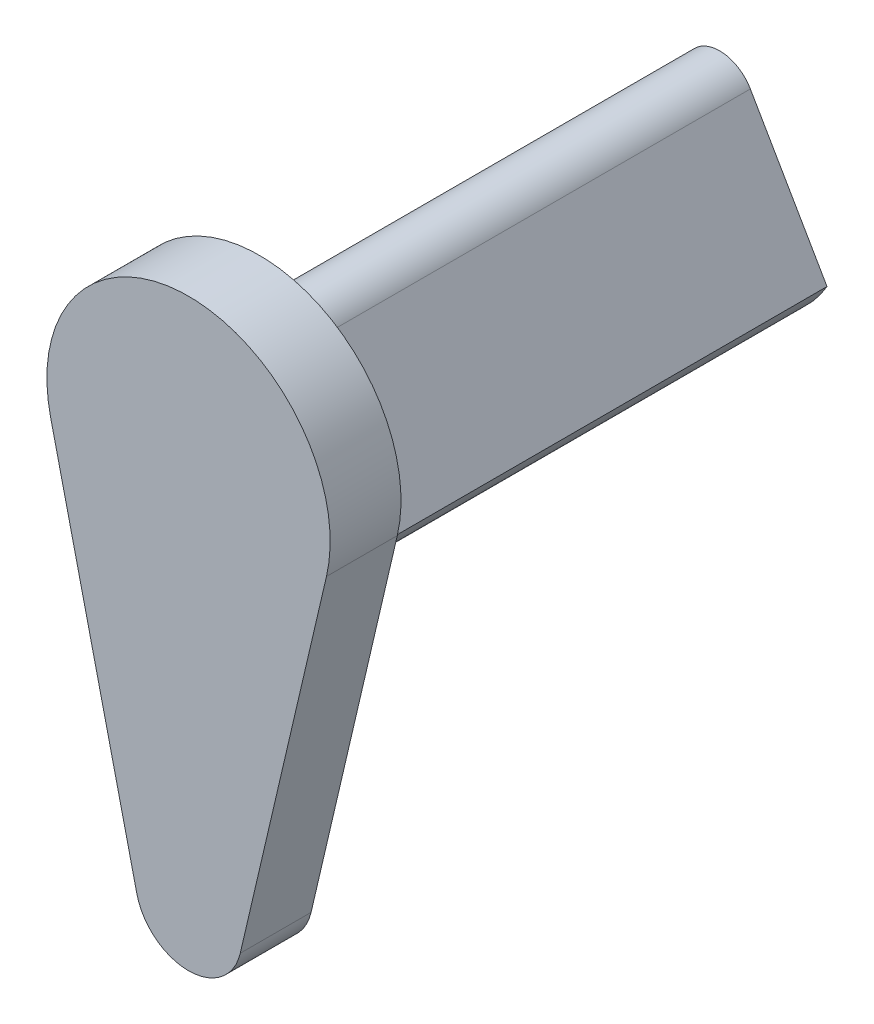
ISO-10303-21;
HEADER;
FILE_DESCRIPTION(('STEP AP214'),'2;1');
FILE_NAME('part.step','',(''),(''),'','','');
FILE_SCHEMA(('AUTOMOTIVE_DESIGN { 1 0 10303 214 1 1 1 1 }'));
ENDSEC;
DATA;
#1=APPLICATION_CONTEXT('core data for automotive mechanical design processes');
#2=APPLICATION_PROTOCOL_DEFINITION('international standard','automotive_design',2000,#1);
#3=PRODUCT_CONTEXT('',#1,'mechanical');
#4=PRODUCT('Part','Part','',(#3));
#5=PRODUCT_RELATED_PRODUCT_CATEGORY('part','',(#4));
#6=PRODUCT_DEFINITION_FORMATION('','',#4);
#7=PRODUCT_DEFINITION_CONTEXT('part definition',#1,'design');
#8=PRODUCT_DEFINITION('design','',#6,#7);
#9=PRODUCT_DEFINITION_SHAPE('','',#8);
#10=(LENGTH_UNIT() NAMED_UNIT(*) SI_UNIT(.MILLI.,.METRE.));
#11=(NAMED_UNIT(*) PLANE_ANGLE_UNIT() SI_UNIT($,.RADIAN.));
#12=(NAMED_UNIT(*) SI_UNIT($,.STERADIAN.) SOLID_ANGLE_UNIT());
#13=UNCERTAINTY_MEASURE_WITH_UNIT(LENGTH_MEASURE(1.E-05),#10,'distance_accuracy_value','');
#14=(GEOMETRIC_REPRESENTATION_CONTEXT(3) GLOBAL_UNCERTAINTY_ASSIGNED_CONTEXT((#13)) GLOBAL_UNIT_ASSIGNED_CONTEXT((#10,
#11,#12)) REPRESENTATION_CONTEXT('',''));
#15=CARTESIAN_POINT('',(0.,0.,0.));
#16=DIRECTION('',(0.,0.,1.));
#17=DIRECTION('',(1.,0.,0.));
#18=AXIS2_PLACEMENT_3D('',#15,#16,#17);
#19=CARTESIAN_POINT('',(0.,0.,13.));
#20=DIRECTION('',(0.,0.,-1.));
#21=DIRECTION('',(-1.,0.,0.));
#22=AXIS2_PLACEMENT_3D('',#19,#20,#21);
#23=CYLINDRICAL_SURFACE('',#22,3.5);
#24=CARTESIAN_POINT('',(0.,0.,0.));
#25=DIRECTION('',(0.,0.,1.));
#26=DIRECTION('',(1.,0.,0.));
#27=AXIS2_PLACEMENT_3D('',#24,#25,#26);
#28=CIRCLE('',#27,3.5);
#29=CARTESIAN_POINT('',(-3.03108891324554,-1.74999999999999,0.));
#30=VERTEX_POINT('',#29);
#31=CARTESIAN_POINT('',(3.03108891324554,-1.74999999999999,0.));
#32=VERTEX_POINT('',#31);
#33=EDGE_CURVE('E109',#30,#32,#28,.T.);
#34=ORIENTED_EDGE('',*,*,#33,.T.);
#35=DIRECTION('',(0.,0.,-1.));
#36=VECTOR('',#35,1.);
#37=CARTESIAN_POINT('',(3.03108891324554,-1.74999999999999,29.5194114800814));
#38=LINE('',#37,#36);
#39=CARTESIAN_POINT('',(3.03108891324554,-1.74999999999999,13.));
#40=VERTEX_POINT('',#39);
#41=EDGE_CURVE('E98',#40,#32,#38,.T.);
#42=ORIENTED_EDGE('',*,*,#41,.F.);
#43=CARTESIAN_POINT('',(0.,0.,13.));
#44=DIRECTION('',(0.,0.,1.));
#45=DIRECTION('',(1.,0.,0.));
#46=AXIS2_PLACEMENT_3D('',#43,#44,#45);
#47=CIRCLE('',#46,3.5);
#48=CARTESIAN_POINT('',(-3.03108891324554,-1.74999999999999,13.));
#49=VERTEX_POINT('',#48);
#50=EDGE_CURVE('E115',#49,#40,#47,.T.);
#51=ORIENTED_EDGE('',*,*,#50,.F.);
#52=DIRECTION('',(0.,0.,-1.));
#53=VECTOR('',#52,1.);
#54=CARTESIAN_POINT('',(-3.03108891324554,-1.74999999999999,29.5194114800814));
#55=LINE('',#54,#53);
#56=EDGE_CURVE('E114',#49,#30,#55,.T.);
#57=ORIENTED_EDGE('',*,*,#56,.T.);
#58=EDGE_LOOP('',(#34,#42,#51,#57));
#59=FACE_BOUND('',#58,.T.);
#60=ADVANCED_FACE('F36',(#59),#23,.T.);
#61=CARTESIAN_POINT('',(0.,0.,0.));
#62=DIRECTION('',(0.,0.,1.));
#63=DIRECTION('',(1.,0.,0.));
#64=AXIS2_PLACEMENT_3D('',#61,#62,#63);
#65=PLANE('',#64);
#66=CARTESIAN_POINT('',(0.,0.,0.));
#67=DIRECTION('',(0.,0.,-1.));
#68=DIRECTION('',(-1.,0.,0.));
#69=AXIS2_PLACEMENT_3D('',#66,#67,#68);
#70=CIRCLE('',#69,1.25);
#71=CARTESIAN_POINT('',(-1.25,0.,0.));
#72=VERTEX_POINT('',#71);
#73=EDGE_CURVE('E136',#72,#72,#70,.T.);
#74=ORIENTED_EDGE('',*,*,#73,.F.);
#75=EDGE_LOOP('',(#74));
#76=FACE_BOUND('',#75,.T.);
#77=DIRECTION('',(-0.500000000000001,-0.866025403784438,0.));
#78=VECTOR('',#77,1.);
#79=CARTESIAN_POINT('',(0.,3.5,0.));
#80=LINE('',#79,#78);
#81=CARTESIAN_POINT('',(-0.866025403784438,2.00000000000001,0.));
#82=VERTEX_POINT('',#81);
#83=EDGE_CURVE('E110',#82,#30,#80,.T.);
#84=ORIENTED_EDGE('',*,*,#83,.F.);
#85=CARTESIAN_POINT('',(0.,1.50000000000001,0.));
#86=DIRECTION('',(0.,0.,1.));
#87=DIRECTION('',(1.,0.,0.));
#88=AXIS2_PLACEMENT_3D('',#85,#86,#87);
#89=CIRCLE('',#88,1.);
#90=CARTESIAN_POINT('',(0.866025403784438,2.00000000000001,0.));
#91=VERTEX_POINT('',#90);
#92=EDGE_CURVE('E58',#82,#91,#89,.F.);
#93=ORIENTED_EDGE('',*,*,#92,.T.);
#94=DIRECTION('',(-0.500000000000001,0.866025403784438,0.));
#95=VECTOR('',#94,1.);
#96=CARTESIAN_POINT('',(0.,3.5,0.));
#97=LINE('',#96,#95);
#98=EDGE_CURVE('E100',#32,#91,#97,.T.);
#99=ORIENTED_EDGE('',*,*,#98,.F.);
#100=ORIENTED_EDGE('',*,*,#33,.F.);
#101=EDGE_LOOP('',(#84,#93,#99,#100));
#102=FACE_BOUND('',#101,.T.);
#103=ADVANCED_FACE('F108',(#76,#102),#65,.F.);
#104=CARTESIAN_POINT('',(0.,0.,15.));
#105=DIRECTION('',(0.,0.,-1.));
#106=DIRECTION('',(-1.,0.,0.));
#107=AXIS2_PLACEMENT_3D('',#104,#105,#106);
#108=CYLINDRICAL_SURFACE('',#107,4.);
#109=CARTESIAN_POINT('',(0.,0.,13.));
#110=DIRECTION('',(0.,0.,1.));
#111=DIRECTION('',(1.,0.,0.));
#112=AXIS2_PLACEMENT_3D('',#109,#110,#111);
#113=CIRCLE('',#112,4.);
#114=CARTESIAN_POINT('',(3.89532459738701,-0.909090909090909,13.));
#115=VERTEX_POINT('',#114);
#116=CARTESIAN_POINT('',(-3.89532459738701,-0.909090909090909,13.));
#117=VERTEX_POINT('',#116);
#118=EDGE_CURVE('E143',#115,#117,#113,.T.);
#119=ORIENTED_EDGE('',*,*,#118,.T.);
#120=DIRECTION('',(0.,0.,-1.));
#121=VECTOR('',#120,1.);
#122=CARTESIAN_POINT('',(-3.89532459738701,-0.909090909090909,15.));
#123=LINE('',#122,#121);
#124=CARTESIAN_POINT('',(-3.89532459738701,-0.909090909090909,15.));
#125=VERTEX_POINT('',#124);
#126=EDGE_CURVE('E116',#125,#117,#123,.T.);
#127=ORIENTED_EDGE('',*,*,#126,.F.);
#128=CARTESIAN_POINT('',(0.,0.,15.));
#129=DIRECTION('',(0.,0.,1.));
#130=DIRECTION('',(1.,0.,0.));
#131=AXIS2_PLACEMENT_3D('',#128,#129,#130);
#132=CIRCLE('',#131,4.);
#133=CARTESIAN_POINT('',(3.89532459738701,-0.909090909090909,15.));
#134=VERTEX_POINT('',#133);
#135=EDGE_CURVE('E144',#134,#125,#132,.T.);
#136=ORIENTED_EDGE('',*,*,#135,.F.);
#137=DIRECTION('',(0.,0.,-1.));
#138=VECTOR('',#137,1.);
#139=CARTESIAN_POINT('',(3.89532459738701,-0.909090909090909,15.));
#140=LINE('',#139,#138);
#141=EDGE_CURVE('E154',#134,#115,#140,.T.);
#142=ORIENTED_EDGE('',*,*,#141,.T.);
#143=EDGE_LOOP('',(#119,#127,#136,#142));
#144=FACE_BOUND('',#143,.T.);
#145=ADVANCED_FACE('F185',(#144),#108,.T.);
#146=CARTESIAN_POINT('',(-3.89532459738701,-0.909090909090909,15.));
#147=DIRECTION('',(0.973831149346752,0.227272727272727,0.));
#148=DIRECTION('',(-0.227272727272727,0.973831149346752,0.));
#149=AXIS2_PLACEMENT_3D('',#146,#147,#148);
#150=PLANE('',#149);
#151=DIRECTION('',(0.227272727272727,-0.973831149346752,0.));
#152=VECTOR('',#151,1.);
#153=CARTESIAN_POINT('',(-3.89532459738701,-0.909090909090909,13.));
#154=LINE('',#153,#152);
#155=CARTESIAN_POINT('',(-1.46074672402013,-11.3409090909091,13.));
#156=VERTEX_POINT('',#155);
#157=EDGE_CURVE('E157',#117,#156,#154,.T.);
#158=ORIENTED_EDGE('',*,*,#157,.T.);
#159=DIRECTION('',(0.,0.,-1.));
#160=VECTOR('',#159,1.);
#161=CARTESIAN_POINT('',(-1.46074672402013,-11.3409090909091,15.));
#162=LINE('',#161,#160);
#163=CARTESIAN_POINT('',(-1.46074672402013,-11.3409090909091,15.));
#164=VERTEX_POINT('',#163);
#165=EDGE_CURVE('E121',#164,#156,#162,.T.);
#166=ORIENTED_EDGE('',*,*,#165,.F.);
#167=DIRECTION('',(0.227272727272727,-0.973831149346752,0.));
#168=VECTOR('',#167,1.);
#169=CARTESIAN_POINT('',(-3.89532459738701,-0.909090909090909,15.));
#170=LINE('',#169,#168);
#171=EDGE_CURVE('E147',#125,#164,#170,.T.);
#172=ORIENTED_EDGE('',*,*,#171,.F.);
#173=ORIENTED_EDGE('',*,*,#126,.T.);
#174=EDGE_LOOP('',(#158,#166,#172,#173));
#175=FACE_BOUND('',#174,.T.);
#176=ADVANCED_FACE('F189',(#175),#150,.F.);
#177=CARTESIAN_POINT('',(0.,-11.,15.));
#178=DIRECTION('',(0.,0.,-1.));
#179=DIRECTION('',(-1.,0.,0.));
#180=AXIS2_PLACEMENT_3D('',#177,#178,#179);
#181=CYLINDRICAL_SURFACE('',#180,1.5);
#182=CARTESIAN_POINT('',(0.,-11.,13.));
#183=DIRECTION('',(0.,0.,1.));
#184=DIRECTION('',(1.,0.,0.));
#185=AXIS2_PLACEMENT_3D('',#182,#183,#184);
#186=CIRCLE('',#185,1.5);
#187=CARTESIAN_POINT('',(1.46074672402013,-11.3409090909091,13.));
#188=VERTEX_POINT('',#187);
#189=EDGE_CURVE('E159',#156,#188,#186,.T.);
#190=ORIENTED_EDGE('',*,*,#189,.T.);
#191=DIRECTION('',(0.,0.,-1.));
#192=VECTOR('',#191,1.);
#193=CARTESIAN_POINT('',(1.46074672402013,-11.3409090909091,15.));
#194=LINE('',#193,#192);
#195=CARTESIAN_POINT('',(1.46074672402013,-11.3409090909091,15.));
#196=VERTEX_POINT('',#195);
#197=EDGE_CURVE('E164',#196,#188,#194,.T.);
#198=ORIENTED_EDGE('',*,*,#197,.F.);
#199=CARTESIAN_POINT('',(0.,-11.,15.));
#200=DIRECTION('',(0.,0.,1.));
#201=DIRECTION('',(1.,0.,0.));
#202=AXIS2_PLACEMENT_3D('',#199,#200,#201);
#203=CIRCLE('',#202,1.5);
#204=EDGE_CURVE('E150',#164,#196,#203,.T.);
#205=ORIENTED_EDGE('',*,*,#204,.F.);
#206=ORIENTED_EDGE('',*,*,#165,.T.);
#207=EDGE_LOOP('',(#190,#198,#205,#206));
#208=FACE_BOUND('',#207,.T.);
#209=ADVANCED_FACE('F172',(#208),#181,.T.);
#210=CARTESIAN_POINT('',(3.89532459738701,-0.909090909090909,15.));
#211=DIRECTION('',(-0.973831149346752,0.227272727272727,0.));
#212=DIRECTION('',(-0.227272727272727,-0.973831149346752,0.));
#213=AXIS2_PLACEMENT_3D('',#210,#211,#212);
#214=PLANE('',#213);
#215=DIRECTION('',(0.227272727272727,0.973831149346752,0.));
#216=VECTOR('',#215,1.);
#217=CARTESIAN_POINT('',(3.89532459738701,-0.909090909090909,13.));
#218=LINE('',#217,#216);
#219=EDGE_CURVE('E148',#188,#115,#218,.T.);
#220=ORIENTED_EDGE('',*,*,#219,.T.);
#221=ORIENTED_EDGE('',*,*,#141,.F.);
#222=DIRECTION('',(0.227272727272727,0.973831149346752,0.));
#223=VECTOR('',#222,1.);
#224=CARTESIAN_POINT('',(3.89532459738701,-0.909090909090909,15.));
#225=LINE('',#224,#223);
#226=EDGE_CURVE('E152',#196,#134,#225,.T.);
#227=ORIENTED_EDGE('',*,*,#226,.F.);
#228=ORIENTED_EDGE('',*,*,#197,.T.);
#229=EDGE_LOOP('',(#220,#221,#227,#228));
#230=FACE_BOUND('',#229,.T.);
#231=ADVANCED_FACE('F181',(#230),#214,.F.);
#232=CARTESIAN_POINT('',(0.,0.,15.));
#233=DIRECTION('',(0.,0.,1.));
#234=DIRECTION('',(1.,0.,0.));
#235=AXIS2_PLACEMENT_3D('',#232,#233,#234);
#236=PLANE('',#235);
#237=ORIENTED_EDGE('',*,*,#135,.T.);
#238=ORIENTED_EDGE('',*,*,#171,.T.);
#239=ORIENTED_EDGE('',*,*,#204,.T.);
#240=ORIENTED_EDGE('',*,*,#226,.T.);
#241=EDGE_LOOP('',(#237,#238,#239,#240));
#242=FACE_BOUND('',#241,.T.);
#243=ADVANCED_FACE('F188',(#242),#236,.T.);
#244=CARTESIAN_POINT('',(0.,0.,13.));
#245=DIRECTION('',(0.,0.,1.));
#246=DIRECTION('',(1.,0.,0.));
#247=AXIS2_PLACEMENT_3D('',#244,#245,#246);
#248=PLANE('',#247);
#249=DIRECTION('',(-0.500000000000001,0.866025403784438,0.));
#250=VECTOR('',#249,1.);
#251=CARTESIAN_POINT('',(0.,3.5,13.));
#252=LINE('',#251,#250);
#253=CARTESIAN_POINT('',(0.866025403784438,2.00000000000001,13.));
#254=VERTEX_POINT('',#253);
#255=EDGE_CURVE('E101',#40,#254,#252,.T.);
#256=ORIENTED_EDGE('',*,*,#255,.T.);
#257=CARTESIAN_POINT('',(0.,1.50000000000001,13.));
#258=DIRECTION('',(0.,0.,1.));
#259=DIRECTION('',(1.,0.,0.));
#260=AXIS2_PLACEMENT_3D('',#257,#258,#259);
#261=CIRCLE('',#260,1.);
#262=CARTESIAN_POINT('',(-0.866025403784438,2.00000000000001,13.));
#263=VERTEX_POINT('',#262);
#264=EDGE_CURVE('E11',#254,#263,#261,.T.);
#265=ORIENTED_EDGE('',*,*,#264,.T.);
#266=DIRECTION('',(-0.500000000000001,-0.866025403784438,0.));
#267=VECTOR('',#266,1.);
#268=CARTESIAN_POINT('',(0.,3.5,13.));
#269=LINE('',#268,#267);
#270=EDGE_CURVE('E130',#263,#49,#269,.T.);
#271=ORIENTED_EDGE('',*,*,#270,.T.);
#272=ORIENTED_EDGE('',*,*,#50,.T.);
#273=EDGE_LOOP('',(#256,#265,#271,#272));
#274=FACE_BOUND('',#273,.T.);
#275=ORIENTED_EDGE('',*,*,#189,.F.);
#276=ORIENTED_EDGE('',*,*,#157,.F.);
#277=ORIENTED_EDGE('',*,*,#118,.F.);
#278=ORIENTED_EDGE('',*,*,#219,.F.);
#279=EDGE_LOOP('',(#275,#276,#277,#278));
#280=FACE_BOUND('',#279,.T.);
#281=ADVANCED_FACE('F177',(#274,#280),#248,.F.);
#282=CARTESIAN_POINT('',(0.,3.5,29.5194114800814));
#283=DIRECTION('',(-0.866025403784438,-0.500000000000001,0.));
#284=DIRECTION('',(0.500000000000001,-0.866025403784438,0.));
#285=AXIS2_PLACEMENT_3D('',#282,#283,#284);
#286=PLANE('',#285);
#287=ORIENTED_EDGE('',*,*,#98,.T.);
#288=DIRECTION('',(0.,0.,-1.));
#289=VECTOR('',#288,1.);
#290=CARTESIAN_POINT('',(0.866025403784438,2.00000000000001,29.5194114800814));
#291=LINE('',#290,#289);
#292=EDGE_CURVE('E44',#91,#254,#291,.F.);
#293=ORIENTED_EDGE('',*,*,#292,.T.);
#294=ORIENTED_EDGE('',*,*,#255,.F.);
#295=ORIENTED_EDGE('',*,*,#41,.T.);
#296=EDGE_LOOP('',(#287,#293,#294,#295));
#297=FACE_BOUND('',#296,.T.);
#298=ADVANCED_FACE('F99',(#297),#286,.F.);
#299=CARTESIAN_POINT('',(0.,3.5,29.5194114800814));
#300=DIRECTION('',(0.866025403784438,-0.500000000000001,0.));
#301=DIRECTION('',(0.500000000000001,0.866025403784438,0.));
#302=AXIS2_PLACEMENT_3D('',#299,#300,#301);
#303=PLANE('',#302);
#304=ORIENTED_EDGE('',*,*,#270,.F.);
#305=DIRECTION('',(0.,0.,-1.));
#306=VECTOR('',#305,1.);
#307=CARTESIAN_POINT('',(-0.866025403784438,2.00000000000001,29.5194114800814));
#308=LINE('',#307,#306);
#309=EDGE_CURVE('E118',#263,#82,#308,.T.);
#310=ORIENTED_EDGE('',*,*,#309,.T.);
#311=ORIENTED_EDGE('',*,*,#83,.T.);
#312=ORIENTED_EDGE('',*,*,#56,.F.);
#313=EDGE_LOOP('',(#304,#310,#311,#312));
#314=FACE_BOUND('',#313,.T.);
#315=ADVANCED_FACE('F129',(#314),#303,.F.);
#316=CARTESIAN_POINT('',(0.,0.,8.));
#317=DIRECTION('',(0.,0.,-1.));
#318=DIRECTION('',(-1.,0.,0.));
#319=AXIS2_PLACEMENT_3D('',#316,#317,#318);
#320=CYLINDRICAL_SURFACE('',#319,1.25);
#321=CARTESIAN_POINT('',(0.,0.,8.));
#322=DIRECTION('',(0.,0.,-1.));
#323=DIRECTION('',(-1.,0.,0.));
#324=AXIS2_PLACEMENT_3D('',#321,#322,#323);
#325=CIRCLE('',#324,1.25);
#326=CARTESIAN_POINT('',(-1.25,0.,8.));
#327=VERTEX_POINT('',#326);
#328=EDGE_CURVE('E133',#327,#327,#325,.T.);
#329=ORIENTED_EDGE('',*,*,#328,.F.);
#330=EDGE_LOOP('',(#329));
#331=FACE_BOUND('',#330,.T.);
#332=ORIENTED_EDGE('',*,*,#73,.T.);
#333=EDGE_LOOP('',(#332));
#334=FACE_BOUND('',#333,.T.);
#335=ADVANCED_FACE('F209',(#331,#334),#320,.F.);
#336=CARTESIAN_POINT('',(0.,0.,8.));
#337=DIRECTION('',(0.,0.,-1.));
#338=DIRECTION('',(-1.,0.,0.));
#339=AXIS2_PLACEMENT_3D('',#336,#337,#338);
#340=PLANE('',#339);
#341=ORIENTED_EDGE('',*,*,#328,.T.);
#342=EDGE_LOOP('',(#341));
#343=FACE_BOUND('',#342,.T.);
#344=ADVANCED_FACE('F211',(#343),#340,.T.);
#345=CARTESIAN_POINT('',(0.,1.50000000000001,29.5194114800814));
#346=DIRECTION('',(0.,0.,-1.));
#347=DIRECTION('',(-1.,0.,0.));
#348=AXIS2_PLACEMENT_3D('',#345,#346,#347);
#349=CYLINDRICAL_SURFACE('',#348,1.);
#350=ORIENTED_EDGE('',*,*,#264,.F.);
#351=ORIENTED_EDGE('',*,*,#292,.F.);
#352=ORIENTED_EDGE('',*,*,#92,.F.);
#353=ORIENTED_EDGE('',*,*,#309,.F.);
#354=EDGE_LOOP('',(#350,#351,#352,#353));
#355=FACE_BOUND('',#354,.T.);
#356=ADVANCED_FACE('F38',(#355),#349,.T.);
#357=CLOSED_SHELL('',(#60,#103,#145,#176,#209,#231,#243,#281,#298,#315,#335,#344,#356));
#358=MANIFOLD_SOLID_BREP('B2',#357);
#359=ADVANCED_BREP_SHAPE_REPRESENTATION('',(#18,#358),#14);
#360=SHAPE_DEFINITION_REPRESENTATION(#9,#359);
ENDSEC;
END-ISO-10303-21;
